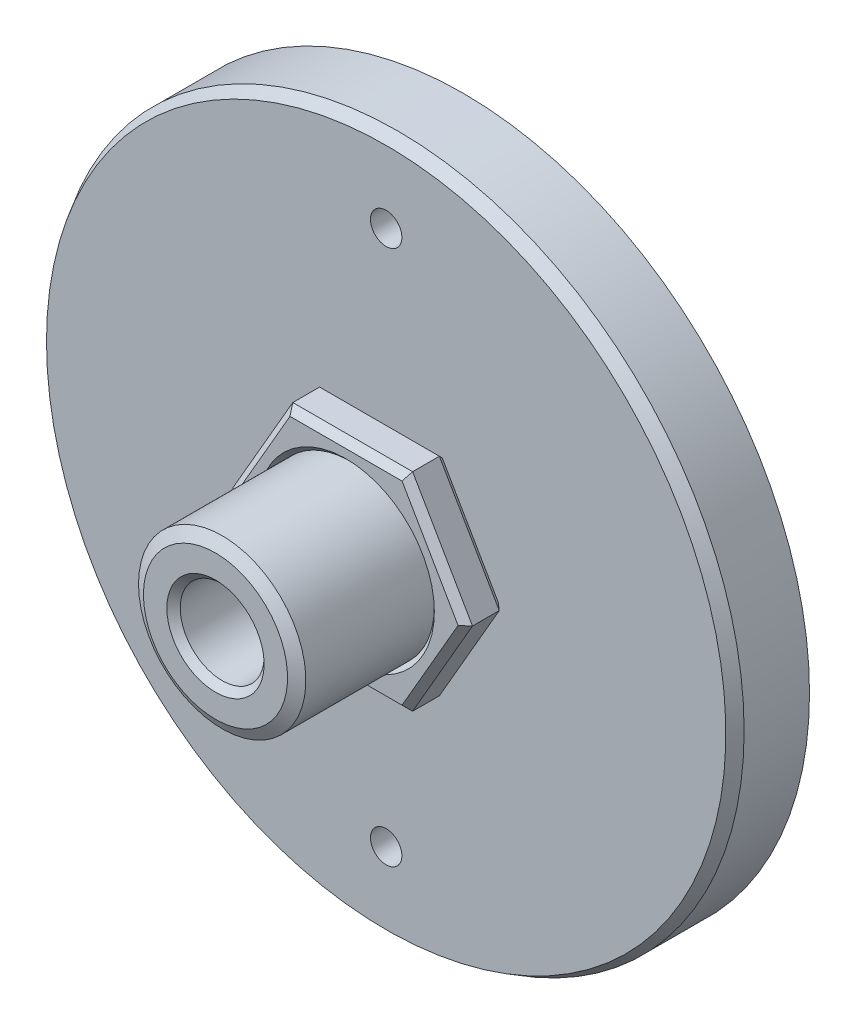
ISO-10303-21;
HEADER;
FILE_DESCRIPTION(('STEP AP214'),'2;1');
FILE_NAME('part.step','',(''),(''),'','','');
FILE_SCHEMA(('AUTOMOTIVE_DESIGN { 1 0 10303 214 1 1 1 1 }'));
ENDSEC;
DATA;
#1=APPLICATION_CONTEXT('core data for automotive mechanical design processes');
#2=APPLICATION_PROTOCOL_DEFINITION('international standard','automotive_design',2000,#1);
#3=PRODUCT_CONTEXT('',#1,'mechanical');
#4=PRODUCT('Part','Part','',(#3));
#5=PRODUCT_RELATED_PRODUCT_CATEGORY('part','',(#4));
#6=PRODUCT_DEFINITION_FORMATION('','',#4);
#7=PRODUCT_DEFINITION_CONTEXT('part definition',#1,'design');
#8=PRODUCT_DEFINITION('design','',#6,#7);
#9=PRODUCT_DEFINITION_SHAPE('','',#8);
#10=(LENGTH_UNIT() NAMED_UNIT(*) SI_UNIT(.MILLI.,.METRE.));
#11=(NAMED_UNIT(*) PLANE_ANGLE_UNIT() SI_UNIT($,.RADIAN.));
#12=(NAMED_UNIT(*) SI_UNIT($,.STERADIAN.) SOLID_ANGLE_UNIT());
#13=UNCERTAINTY_MEASURE_WITH_UNIT(LENGTH_MEASURE(1.E-05),#10,'distance_accuracy_value','');
#14=(GEOMETRIC_REPRESENTATION_CONTEXT(3) GLOBAL_UNCERTAINTY_ASSIGNED_CONTEXT((#13)) GLOBAL_UNIT_ASSIGNED_CONTEXT((#10,
#11,#12)) REPRESENTATION_CONTEXT('',''));
#15=CARTESIAN_POINT('',(0.,0.,0.));
#16=DIRECTION('',(0.,0.,1.));
#17=DIRECTION('',(1.,0.,0.));
#18=AXIS2_PLACEMENT_3D('',#15,#16,#17);
#19=CARTESIAN_POINT('',(2.27302800979955,-3.93700000000001,0.));
#20=DIRECTION('',(0.,1.,0.));
#21=DIRECTION('',(1.,0.,0.));
#22=AXIS2_PLACEMENT_3D('',#19,#20,#21);
#23=PLANE('',#22);
#24=DIRECTION('',(0.,0.,1.));
#25=VECTOR('',#24,1.);
#26=CARTESIAN_POINT('',(2.27302800979955,-3.93700000000001,0.));
#27=LINE('',#26,#25);
#28=CARTESIAN_POINT('',(2.27302800979955,-3.93700000000001,0.254000000000002));
#29=VERTEX_POINT('',#28);
#30=CARTESIAN_POINT('',(2.27302800979955,-3.93700000000001,1.27));
#31=VERTEX_POINT('',#30);
#32=EDGE_CURVE('P0_E212',#29,#31,#27,.T.);
#33=ORIENTED_EDGE('',*,*,#32,.T.);
#34=DIRECTION('',(-1.,0.,0.));
#35=VECTOR('',#34,1.);
#36=CARTESIAN_POINT('',(2.27302800979955,-3.93700000000001,1.27));
#37=LINE('',#36,#35);
#38=CARTESIAN_POINT('',(-2.27302800979955,-3.93700000000001,1.27));
#39=VERTEX_POINT('',#38);
#40=EDGE_CURVE('P0_E178',#31,#39,#37,.T.);
#41=ORIENTED_EDGE('',*,*,#40,.T.);
#42=DIRECTION('',(0.,0.,1.));
#43=VECTOR('',#42,1.);
#44=CARTESIAN_POINT('',(-2.27302800979955,-3.93700000000001,0.));
#45=LINE('',#44,#43);
#46=CARTESIAN_POINT('',(-2.27302800979955,-3.93700000000001,0.254000000000003));
#47=VERTEX_POINT('',#46);
#48=EDGE_CURVE('P0_E128',#47,#39,#45,.T.);
#49=ORIENTED_EDGE('',*,*,#48,.F.);
#50=DIRECTION('',(1.,0.,0.));
#51=VECTOR('',#50,1.);
#52=CARTESIAN_POINT('',(2.27302800979955,-3.93700000000001,0.254000000000002));
#53=LINE('',#52,#51);
#54=EDGE_CURVE('P0_E176',#47,#29,#53,.T.);
#55=ORIENTED_EDGE('',*,*,#54,.T.);
#56=EDGE_LOOP('',(#33,#41,#49,#55));
#57=FACE_BOUND('',#56,.T.);
#58=ADVANCED_FACE('P0_F16',(#57),#23,.F.);
#59=CARTESIAN_POINT('',(-2.27302800979955,-3.93700000000001,0.));
#60=DIRECTION('',(0.866025403784439,0.499999999999999,0.));
#61=DIRECTION('',(0.499999999999999,-0.866025403784439,0.));
#62=AXIS2_PLACEMENT_3D('',#59,#60,#61);
#63=PLANE('',#62);
#64=ORIENTED_EDGE('',*,*,#48,.T.);
#65=DIRECTION('',(-0.499999999999999,0.866025403784439,0.));
#66=VECTOR('',#65,1.);
#67=CARTESIAN_POINT('',(-2.27302800979955,-3.93700000000001,1.27));
#68=LINE('',#67,#66);
#69=CARTESIAN_POINT('',(-4.54605601959911,0.,1.27));
#70=VERTEX_POINT('',#69);
#71=EDGE_CURVE('P0_E127',#39,#70,#68,.T.);
#72=ORIENTED_EDGE('',*,*,#71,.T.);
#73=DIRECTION('',(0.,0.,1.));
#74=VECTOR('',#73,1.);
#75=CARTESIAN_POINT('',(-4.54605601959911,0.,0.));
#76=LINE('',#75,#74);
#77=CARTESIAN_POINT('',(-4.54605601959911,0.,0.254000000000003));
#78=VERTEX_POINT('',#77);
#79=EDGE_CURVE('P0_E109',#78,#70,#76,.T.);
#80=ORIENTED_EDGE('',*,*,#79,.F.);
#81=DIRECTION('',(0.499999999999999,-0.866025403784439,0.));
#82=VECTOR('',#81,1.);
#83=CARTESIAN_POINT('',(-2.27302800979955,-3.93700000000001,0.254000000000003));
#84=LINE('',#83,#82);
#85=EDGE_CURVE('P0_E124',#78,#47,#84,.T.);
#86=ORIENTED_EDGE('',*,*,#85,.T.);
#87=EDGE_LOOP('',(#64,#72,#80,#86));
#88=FACE_BOUND('',#87,.T.);
#89=ADVANCED_FACE('P0_F122',(#88),#63,.F.);
#90=CARTESIAN_POINT('',(-4.54605601959911,0.,0.));
#91=DIRECTION('',(0.866025403784438,-0.5,0.));
#92=DIRECTION('',(0.,0.,1.));
#93=AXIS2_PLACEMENT_3D('',#90,#91,#92);
#94=PLANE('',#93);
#95=ORIENTED_EDGE('',*,*,#79,.T.);
#96=DIRECTION('',(0.5,0.866025403784439,0.));
#97=VECTOR('',#96,1.);
#98=CARTESIAN_POINT('',(-4.54605601959911,0.,1.27));
#99=LINE('',#98,#97);
#100=CARTESIAN_POINT('',(-2.27302800979955,3.93700000000001,1.27));
#101=VERTEX_POINT('',#100);
#102=EDGE_CURVE('P0_E116',#70,#101,#99,.T.);
#103=ORIENTED_EDGE('',*,*,#102,.T.);
#104=DIRECTION('',(0.,0.,1.));
#105=VECTOR('',#104,1.);
#106=CARTESIAN_POINT('',(-2.27302800979955,3.93700000000001,0.));
#107=LINE('',#106,#105);
#108=CARTESIAN_POINT('',(-2.27302800979955,3.93700000000001,0.254000000000003));
#109=VERTEX_POINT('',#108);
#110=EDGE_CURVE('P0_E111',#109,#101,#107,.T.);
#111=ORIENTED_EDGE('',*,*,#110,.F.);
#112=DIRECTION('',(-0.5,-0.866025403784439,0.));
#113=VECTOR('',#112,1.);
#114=CARTESIAN_POINT('',(-4.54605601959911,0.,0.254000000000003));
#115=LINE('',#114,#113);
#116=EDGE_CURVE('P0_E106',#109,#78,#115,.T.);
#117=ORIENTED_EDGE('',*,*,#116,.T.);
#118=EDGE_LOOP('',(#95,#103,#111,#117));
#119=FACE_BOUND('',#118,.T.);
#120=ADVANCED_FACE('P0_F108',(#119),#94,.F.);
#121=CARTESIAN_POINT('',(-2.27302800979955,3.93700000000001,0.));
#122=DIRECTION('',(0.,-1.,0.));
#123=DIRECTION('',(-1.,0.,0.));
#124=AXIS2_PLACEMENT_3D('',#121,#122,#123);
#125=PLANE('',#124);
#126=ORIENTED_EDGE('',*,*,#110,.T.);
#127=DIRECTION('',(1.,0.,0.));
#128=VECTOR('',#127,1.);
#129=CARTESIAN_POINT('',(-2.27302800979955,3.93700000000001,1.27));
#130=LINE('',#129,#128);
#131=CARTESIAN_POINT('',(2.27302800979956,3.93700000000001,1.27));
#132=VERTEX_POINT('',#131);
#133=EDGE_CURVE('P0_E165',#101,#132,#130,.T.);
#134=ORIENTED_EDGE('',*,*,#133,.T.);
#135=DIRECTION('',(0.,0.,1.));
#136=VECTOR('',#135,1.);
#137=CARTESIAN_POINT('',(2.27302800979956,3.93700000000001,0.));
#138=LINE('',#137,#136);
#139=CARTESIAN_POINT('',(2.27302800979956,3.93700000000001,0.254000000000002));
#140=VERTEX_POINT('',#139);
#141=EDGE_CURVE('P0_E230',#140,#132,#138,.T.);
#142=ORIENTED_EDGE('',*,*,#141,.F.);
#143=DIRECTION('',(-1.,0.,0.));
#144=VECTOR('',#143,1.);
#145=CARTESIAN_POINT('',(-2.27302800979955,3.93700000000001,0.254000000000003));
#146=LINE('',#145,#144);
#147=EDGE_CURVE('P0_E163',#140,#109,#146,.T.);
#148=ORIENTED_EDGE('',*,*,#147,.T.);
#149=EDGE_LOOP('',(#126,#134,#142,#148));
#150=FACE_BOUND('',#149,.T.);
#151=ADVANCED_FACE('P0_F227',(#150),#125,.F.);
#152=CARTESIAN_POINT('',(2.27302800979956,3.93700000000001,0.));
#153=DIRECTION('',(-0.866025403784439,-0.499999999999999,0.));
#154=DIRECTION('',(-0.5,0.866025403784439,0.));
#155=AXIS2_PLACEMENT_3D('',#152,#153,#154);
#156=PLANE('',#155);
#157=ORIENTED_EDGE('',*,*,#141,.T.);
#158=DIRECTION('',(0.5,-0.866025403784439,0.));
#159=VECTOR('',#158,1.);
#160=CARTESIAN_POINT('',(2.27302800979956,3.93700000000001,1.27));
#161=LINE('',#160,#159);
#162=CARTESIAN_POINT('',(4.54605601959912,0.,1.27));
#163=VERTEX_POINT('',#162);
#164=EDGE_CURVE('P0_E169',#132,#163,#161,.T.);
#165=ORIENTED_EDGE('',*,*,#164,.T.);
#166=DIRECTION('',(0.,0.,1.));
#167=VECTOR('',#166,1.);
#168=CARTESIAN_POINT('',(4.54605601959912,0.,0.));
#169=LINE('',#168,#167);
#170=CARTESIAN_POINT('',(4.54605601959912,0.,0.254000000000002));
#171=VERTEX_POINT('',#170);
#172=EDGE_CURVE('P0_E233',#171,#163,#169,.T.);
#173=ORIENTED_EDGE('',*,*,#172,.F.);
#174=DIRECTION('',(-0.5,0.866025403784439,0.));
#175=VECTOR('',#174,1.);
#176=CARTESIAN_POINT('',(2.27302800979956,3.93700000000001,0.254000000000002));
#177=LINE('',#176,#175);
#178=EDGE_CURVE('P0_E167',#171,#140,#177,.T.);
#179=ORIENTED_EDGE('',*,*,#178,.T.);
#180=EDGE_LOOP('',(#157,#165,#173,#179));
#181=FACE_BOUND('',#180,.T.);
#182=ADVANCED_FACE('P0_F272',(#181),#156,.F.);
#183=CARTESIAN_POINT('',(4.54605601959912,0.,0.));
#184=DIRECTION('',(-0.866025403784438,0.5,0.));
#185=DIRECTION('',(0.500000000000001,0.866025403784438,0.));
#186=AXIS2_PLACEMENT_3D('',#183,#184,#185);
#187=PLANE('',#186);
#188=ORIENTED_EDGE('',*,*,#172,.T.);
#189=DIRECTION('',(-0.500000000000001,-0.866025403784438,0.));
#190=VECTOR('',#189,1.);
#191=CARTESIAN_POINT('',(4.54605601959912,0.,1.27));
#192=LINE('',#191,#190);
#193=EDGE_CURVE('P0_E174',#163,#31,#192,.T.);
#194=ORIENTED_EDGE('',*,*,#193,.T.);
#195=ORIENTED_EDGE('',*,*,#32,.F.);
#196=DIRECTION('',(0.500000000000001,0.866025403784438,0.));
#197=VECTOR('',#196,1.);
#198=CARTESIAN_POINT('',(4.54605601959912,0.,0.254000000000002));
#199=LINE('',#198,#197);
#200=EDGE_CURVE('P0_E171',#29,#171,#199,.T.);
#201=ORIENTED_EDGE('',*,*,#200,.T.);
#202=EDGE_LOOP('',(#188,#194,#195,#201));
#203=FACE_BOUND('',#202,.T.);
#204=ADVANCED_FACE('P0_F273',(#203),#187,.F.);
#205=CARTESIAN_POINT('',(-2.27302800979955,-3.93700000000001,0.));
#206=DIRECTION('',(0.,0.,-1.));
#207=DIRECTION('',(-0.5,-0.866025403784439,0.));
#208=AXIS2_PLACEMENT_3D('',#205,#206,#207);
#209=PLANE('',#208);
#210=DIRECTION('',(0.5,-0.866025403784439,0.));
#211=VECTOR('',#210,1.);
#212=CARTESIAN_POINT('',(4.32608556703787,-0.126999999999993,0.));
#213=LINE('',#212,#211);
#214=CARTESIAN_POINT('',(2.1263810414254,3.68300000000001,0.));
#215=VERTEX_POINT('',#214);
#216=CARTESIAN_POINT('',(4.25276208285078,0.,0.));
#217=VERTEX_POINT('',#216);
#218=EDGE_CURVE('P0_E25',#215,#217,#213,.T.);
#219=ORIENTED_EDGE('',*,*,#218,.T.);
#220=DIRECTION('',(-0.500000000000001,-0.866025403784438,0.));
#221=VECTOR('',#220,1.);
#222=CARTESIAN_POINT('',(2.0530575572383,-3.81000000000001,0.));
#223=LINE('',#222,#221);
#224=CARTESIAN_POINT('',(2.12638104142538,-3.68300000000001,0.));
#225=VERTEX_POINT('',#224);
#226=EDGE_CURVE('P0_E11',#217,#225,#223,.T.);
#227=ORIENTED_EDGE('',*,*,#226,.T.);
#228=DIRECTION('',(-1.,0.,0.));
#229=VECTOR('',#228,1.);
#230=CARTESIAN_POINT('',(-2.27302800979955,-3.683,0.));
#231=LINE('',#230,#229);
#232=CARTESIAN_POINT('',(-2.12638104142538,-3.683,0.));
#233=VERTEX_POINT('',#232);
#234=EDGE_CURVE('P0_E189',#225,#233,#231,.T.);
#235=ORIENTED_EDGE('',*,*,#234,.T.);
#236=DIRECTION('',(-0.499999999999999,0.866025403784439,0.));
#237=VECTOR('',#236,1.);
#238=CARTESIAN_POINT('',(-4.32608556703786,0.127000000000012,0.));
#239=LINE('',#238,#237);
#240=CARTESIAN_POINT('',(-4.25276208285078,0.,0.));
#241=VERTEX_POINT('',#240);
#242=EDGE_CURVE('P0_E191',#233,#241,#239,.T.);
#243=ORIENTED_EDGE('',*,*,#242,.T.);
#244=DIRECTION('',(0.5,0.866025403784439,0.));
#245=VECTOR('',#244,1.);
#246=CARTESIAN_POINT('',(-2.05305755723831,3.81000000000001,0.));
#247=LINE('',#246,#245);
#248=CARTESIAN_POINT('',(-2.12638104142539,3.68300000000001,0.));
#249=VERTEX_POINT('',#248);
#250=EDGE_CURVE('P0_E134',#241,#249,#247,.T.);
#251=ORIENTED_EDGE('',*,*,#250,.T.);
#252=DIRECTION('',(1.,0.,0.));
#253=VECTOR('',#252,1.);
#254=CARTESIAN_POINT('',(2.27302800979956,3.68300000000001,0.));
#255=LINE('',#254,#253);
#256=EDGE_CURVE('P0_E36',#249,#215,#255,.T.);
#257=ORIENTED_EDGE('',*,*,#256,.T.);
#258=EDGE_LOOP('',(#219,#227,#235,#243,#251,#257));
#259=FACE_BOUND('',#258,.T.);
#260=CARTESIAN_POINT('',(0.,0.,0.));
#261=DIRECTION('',(0.,0.,-1.));
#262=DIRECTION('',(-0.5,-0.866025403784439,0.));
#263=AXIS2_PLACEMENT_3D('',#260,#261,#262);
#264=CIRCLE('',#263,3.35280000000001);
#265=CARTESIAN_POINT('',(-1.6764,-2.90360997380847,0.));
#266=VERTEX_POINT('',#265);
#267=EDGE_CURVE('P0_E186',#266,#266,#264,.F.);
#268=ORIENTED_EDGE('',*,*,#267,.T.);
#269=EDGE_LOOP('',(#268));
#270=FACE_BOUND('',#269,.T.);
#271=ADVANCED_FACE('P0_F281',(#259,#270),#209,.T.);
#272=CARTESIAN_POINT('',(-2.27302800979955,-3.93700000000001,1.524));
#273=DIRECTION('',(0.,0.,-1.));
#274=DIRECTION('',(-0.5,-0.866025403784439,0.));
#275=AXIS2_PLACEMENT_3D('',#272,#273,#274);
#276=PLANE('',#275);
#277=DIRECTION('',(-0.5,-0.866025403784439,0.));
#278=VECTOR('',#277,1.);
#279=CARTESIAN_POINT('',(-5.46259957193765,-2.0955,1.524));
#280=LINE('',#279,#278);
#281=CARTESIAN_POINT('',(-2.12638104142539,3.68300000000001,1.524));
#282=VERTEX_POINT('',#281);
#283=CARTESIAN_POINT('',(-4.25276208285078,0.,1.524));
#284=VERTEX_POINT('',#283);
#285=EDGE_CURVE('P0_E158',#282,#284,#280,.T.);
#286=ORIENTED_EDGE('',*,*,#285,.T.);
#287=DIRECTION('',(0.499999999999999,-0.866025403784439,0.));
#288=VECTOR('',#287,1.);
#289=CARTESIAN_POINT('',(-2.0530575572383,-3.81000000000001,1.524));
#290=LINE('',#289,#288);
#291=CARTESIAN_POINT('',(-2.12638104142538,-3.683,1.524));
#292=VERTEX_POINT('',#291);
#293=EDGE_CURVE('P0_E117',#284,#292,#290,.T.);
#294=ORIENTED_EDGE('',*,*,#293,.T.);
#295=DIRECTION('',(1.,0.,0.));
#296=VECTOR('',#295,1.);
#297=CARTESIAN_POINT('',(-2.27302800979955,-3.683,1.524));
#298=LINE('',#297,#296);
#299=CARTESIAN_POINT('',(2.12638104142538,-3.68300000000001,1.524));
#300=VERTEX_POINT('',#299);
#301=EDGE_CURVE('P0_E150',#292,#300,#298,.T.);
#302=ORIENTED_EDGE('',*,*,#301,.T.);
#303=DIRECTION('',(0.500000000000001,0.866025403784438,0.));
#304=VECTOR('',#303,1.);
#305=CARTESIAN_POINT('',(0.916543552338524,-5.7785,1.524));
#306=LINE('',#305,#304);
#307=CARTESIAN_POINT('',(4.25276208285078,0.,1.524));
#308=VERTEX_POINT('',#307);
#309=EDGE_CURVE('P0_E152',#300,#308,#306,.T.);
#310=ORIENTED_EDGE('',*,*,#309,.T.);
#311=DIRECTION('',(-0.5,0.866025403784439,0.));
#312=VECTOR('',#311,1.);
#313=CARTESIAN_POINT('',(4.32608556703788,-0.127000000000009,1.524));
#314=LINE('',#313,#312);
#315=CARTESIAN_POINT('',(2.1263810414254,3.68300000000001,1.524));
#316=VERTEX_POINT('',#315);
#317=EDGE_CURVE('P0_E154',#308,#316,#314,.T.);
#318=ORIENTED_EDGE('',*,*,#317,.T.);
#319=DIRECTION('',(-1.,0.,0.));
#320=VECTOR('',#319,1.);
#321=CARTESIAN_POINT('',(-2.27302800979955,3.68300000000001,1.524));
#322=LINE('',#321,#320);
#323=EDGE_CURVE('P0_E156',#316,#282,#322,.T.);
#324=ORIENTED_EDGE('',*,*,#323,.T.);
#325=EDGE_LOOP('',(#286,#294,#302,#310,#318,#324));
#326=FACE_BOUND('',#325,.T.);
#327=CARTESIAN_POINT('',(0.,0.,1.524));
#328=DIRECTION('',(0.,0.,-1.));
#329=DIRECTION('',(-0.5,-0.866025403784439,0.));
#330=AXIS2_PLACEMENT_3D('',#327,#328,#329);
#331=CIRCLE('',#330,3.35279999999999);
#332=CARTESIAN_POINT('',(-1.6764,-2.90360997380846,1.524));
#333=VERTEX_POINT('',#332);
#334=EDGE_CURVE('P0_E144',#333,#333,#331,.T.);
#335=ORIENTED_EDGE('',*,*,#334,.T.);
#336=EDGE_LOOP('',(#335));
#337=FACE_BOUND('',#336,.T.);
#338=ADVANCED_FACE('P0_F284',(#326,#337),#276,.F.);
#339=CARTESIAN_POINT('',(0.,0.,1.524));
#340=DIRECTION('',(0.,0.,-1.));
#341=DIRECTION('',(-0.5,-0.866025403784439,0.));
#342=AXIS2_PLACEMENT_3D('',#339,#340,#341);
#343=CYLINDRICAL_SURFACE('',#342,3.0988);
#344=CARTESIAN_POINT('',(0.,0.,1.27000000000001));
#345=DIRECTION('',(0.,0.,-1.));
#346=DIRECTION('',(-0.5,-0.866025403784439,0.));
#347=AXIS2_PLACEMENT_3D('',#344,#345,#346);
#348=CIRCLE('',#347,3.0988);
#349=CARTESIAN_POINT('',(-1.5494,-2.68363952124722,1.27000000000001));
#350=VERTEX_POINT('',#349);
#351=EDGE_CURVE('P0_E183',#350,#350,#348,.F.);
#352=ORIENTED_EDGE('',*,*,#351,.T.);
#353=EDGE_LOOP('',(#352));
#354=FACE_BOUND('',#353,.T.);
#355=CARTESIAN_POINT('',(0.,0.,0.254000000000005));
#356=DIRECTION('',(0.,0.,-1.));
#357=DIRECTION('',(-0.5,-0.866025403784439,0.));
#358=AXIS2_PLACEMENT_3D('',#355,#356,#357);
#359=CIRCLE('',#358,3.0988);
#360=CARTESIAN_POINT('',(-1.5494,-2.68363952124722,0.254000000000005));
#361=VERTEX_POINT('',#360);
#362=EDGE_CURVE('P0_E180',#361,#361,#359,.T.);
#363=ORIENTED_EDGE('',*,*,#362,.T.);
#364=EDGE_LOOP('',(#363));
#365=FACE_BOUND('',#364,.T.);
#366=ADVANCED_FACE('P0_F292',(#354,#365),#343,.F.);
#367=CARTESIAN_POINT('',(2.27302800979956,3.93700000000001,1.27));
#368=DIRECTION('',(-0.612372435695793,-0.353553390593272,-0.707106781186549));
#369=DIRECTION('',(-0.377964473009228,-0.654653670707979,0.654653670707975));
#370=AXIS2_PLACEMENT_3D('',#367,#368,#369);
#371=PLANE('',#370);
#372=DIRECTION('',(-0.377964473009231,-0.654653670707976,0.654653670707976));
#373=VECTOR('',#372,1.);
#374=CARTESIAN_POINT('',(2.27302800979956,3.93700000000001,1.27));
#375=LINE('',#374,#373);
#376=EDGE_CURVE('P0_E206',#316,#132,#375,.F.);
#377=ORIENTED_EDGE('',*,*,#376,.F.);
#378=ORIENTED_EDGE('',*,*,#317,.F.);
#379=DIRECTION('',(-0.755928946018456,0.,0.654653670707975));
#380=VECTOR('',#379,1.);
#381=CARTESIAN_POINT('',(4.54605601959912,0.,1.27));
#382=LINE('',#381,#380);
#383=EDGE_CURVE('P0_E209',#163,#308,#382,.T.);
#384=ORIENTED_EDGE('',*,*,#383,.F.);
#385=ORIENTED_EDGE('',*,*,#164,.F.);
#386=EDGE_LOOP('',(#377,#378,#384,#385));
#387=FACE_BOUND('',#386,.T.);
#388=ADVANCED_FACE('P0_F269',(#387),#371,.F.);
#389=CARTESIAN_POINT('',(4.54605601959912,0.,1.27));
#390=DIRECTION('',(-0.612372435695792,0.353553390593273,-0.70710678118655));
#391=DIRECTION('',(0.612372435695796,-0.353553390593275,-0.707106781186545));
#392=AXIS2_PLACEMENT_3D('',#389,#390,#391);
#393=PLANE('',#392);
#394=ORIENTED_EDGE('',*,*,#383,.T.);
#395=ORIENTED_EDGE('',*,*,#309,.F.);
#396=DIRECTION('',(-0.377964473009229,0.654653670707978,0.654653670707975));
#397=VECTOR('',#396,1.);
#398=CARTESIAN_POINT('',(2.27302800979955,-3.93700000000001,1.27));
#399=LINE('',#398,#397);
#400=EDGE_CURVE('P0_E203',#31,#300,#399,.T.);
#401=ORIENTED_EDGE('',*,*,#400,.F.);
#402=ORIENTED_EDGE('',*,*,#193,.F.);
#403=EDGE_LOOP('',(#394,#395,#401,#402));
#404=FACE_BOUND('',#403,.T.);
#405=ADVANCED_FACE('P0_F249',(#404),#393,.F.);
#406=CARTESIAN_POINT('',(-2.27302800979955,3.93700000000001,1.27));
#407=DIRECTION('',(0.,-0.707106781186547,-0.707106781186547));
#408=DIRECTION('',(-0.377964473009227,-0.654653670707977,0.654653670707977));
#409=AXIS2_PLACEMENT_3D('',#406,#407,#408);
#410=PLANE('',#409);
#411=ORIENTED_EDGE('',*,*,#376,.T.);
#412=ORIENTED_EDGE('',*,*,#133,.F.);
#413=DIRECTION('',(0.377964473009232,-0.654653670707976,0.654653670707976));
#414=VECTOR('',#413,1.);
#415=CARTESIAN_POINT('',(-2.27302800979955,3.93700000000001,1.27));
#416=LINE('',#415,#414);
#417=EDGE_CURVE('P0_E200',#282,#101,#416,.F.);
#418=ORIENTED_EDGE('',*,*,#417,.F.);
#419=ORIENTED_EDGE('',*,*,#323,.F.);
#420=EDGE_LOOP('',(#411,#412,#418,#419));
#421=FACE_BOUND('',#420,.T.);
#422=ADVANCED_FACE('P0_F265',(#421),#410,.F.);
#423=CARTESIAN_POINT('',(2.27302800979955,-3.93700000000001,1.27));
#424=DIRECTION('',(0.,0.707106781186546,-0.707106781186549));
#425=DIRECTION('',(-0.377964473009228,-0.654653670707978,-0.654653670707976));
#426=AXIS2_PLACEMENT_3D('',#423,#424,#425);
#427=PLANE('',#426);
#428=ORIENTED_EDGE('',*,*,#400,.T.);
#429=ORIENTED_EDGE('',*,*,#301,.F.);
#430=DIRECTION('',(-0.37796447300923,-0.654653670707978,-0.654653670707975));
#431=VECTOR('',#430,1.);
#432=CARTESIAN_POINT('',(-1.6235914355711,-2.81214285714286,2.39485714285714));
#433=LINE('',#432,#431);
#434=EDGE_CURVE('P0_E198',#39,#292,#433,.F.);
#435=ORIENTED_EDGE('',*,*,#434,.F.);
#436=ORIENTED_EDGE('',*,*,#40,.F.);
#437=EDGE_LOOP('',(#428,#429,#435,#436));
#438=FACE_BOUND('',#437,.T.);
#439=ADVANCED_FACE('P0_F253',(#438),#427,.F.);
#440=CARTESIAN_POINT('',(-4.54605601959911,0.,1.27));
#441=DIRECTION('',(0.612372435695792,-0.353553390593273,-0.70710678118655));
#442=DIRECTION('',(0.612372435695797,-0.353553390593275,0.707106781186545));
#443=AXIS2_PLACEMENT_3D('',#440,#441,#442);
#444=PLANE('',#443);
#445=ORIENTED_EDGE('',*,*,#417,.T.);
#446=ORIENTED_EDGE('',*,*,#102,.F.);
#447=DIRECTION('',(0.755928946018457,0.,0.654653670707975));
#448=VECTOR('',#447,1.);
#449=CARTESIAN_POINT('',(-4.54605601959911,0.,1.27));
#450=LINE('',#449,#448);
#451=EDGE_CURVE('P0_E196',#284,#70,#450,.F.);
#452=ORIENTED_EDGE('',*,*,#451,.F.);
#453=ORIENTED_EDGE('',*,*,#285,.F.);
#454=EDGE_LOOP('',(#445,#446,#452,#453));
#455=FACE_BOUND('',#454,.T.);
#456=ADVANCED_FACE('P0_F261',(#455),#444,.F.);
#457=CARTESIAN_POINT('',(-2.27302800979955,-3.93700000000001,1.27));
#458=DIRECTION('',(0.612372435695793,0.353553390593272,-0.70710678118655));
#459=DIRECTION('',(-0.377964473009228,-0.654653670707979,-0.654653670707975));
#460=AXIS2_PLACEMENT_3D('',#457,#458,#459);
#461=PLANE('',#460);
#462=ORIENTED_EDGE('',*,*,#434,.T.);
#463=ORIENTED_EDGE('',*,*,#293,.F.);
#464=ORIENTED_EDGE('',*,*,#451,.T.);
#465=ORIENTED_EDGE('',*,*,#71,.F.);
#466=EDGE_LOOP('',(#462,#463,#464,#465));
#467=FACE_BOUND('',#466,.T.);
#468=ADVANCED_FACE('P0_F256',(#467),#461,.F.);
#469=CARTESIAN_POINT('',(0.,0.,1.524));
#470=DIRECTION('',(0.,0.,1.));
#471=DIRECTION('',(0.5,0.866025403784439,0.));
#472=AXIS2_PLACEMENT_3D('',#469,#470,#471);
#473=CONICAL_SURFACE('',#472,3.35279999999999,0.785398163397449);
#474=ORIENTED_EDGE('',*,*,#351,.F.);
#475=EDGE_LOOP('',(#474));
#476=FACE_BOUND('',#475,.T.);
#477=ORIENTED_EDGE('',*,*,#334,.F.);
#478=EDGE_LOOP('',(#477));
#479=FACE_BOUND('',#478,.T.);
#480=ADVANCED_FACE('P0_F314',(#476,#479),#473,.F.);
#481=CARTESIAN_POINT('',(-5.46259957193765,-2.0955,0.));
#482=DIRECTION('',(-0.612372435695797,0.353553390593275,-0.707106781186545));
#483=DIRECTION('',(0.612372435695792,-0.353553390593273,-0.70710678118655));
#484=AXIS2_PLACEMENT_3D('',#481,#482,#483);
#485=PLANE('',#484);
#486=DIRECTION('',(0.755928946018452,0.,-0.65465367070798));
#487=VECTOR('',#486,1.);
#488=CARTESIAN_POINT('',(-2.99578806821508,0.,-1.08857142857143));
#489=LINE('',#488,#487);
#490=EDGE_CURVE('P0_E132',#78,#241,#489,.T.);
#491=ORIENTED_EDGE('',*,*,#490,.F.);
#492=ORIENTED_EDGE('',*,*,#116,.F.);
#493=DIRECTION('',(0.37796447300923,-0.654653670707972,-0.654653670707981));
#494=VECTOR('',#493,1.);
#495=CARTESIAN_POINT('',(-1.17317574699332,2.03200000000004,-1.65099999999999));
#496=LINE('',#495,#494);
#497=EDGE_CURVE('P0_E20',#249,#109,#496,.F.);
#498=ORIENTED_EDGE('',*,*,#497,.F.);
#499=ORIENTED_EDGE('',*,*,#250,.F.);
#500=EDGE_LOOP('',(#491,#492,#498,#499));
#501=FACE_BOUND('',#500,.T.);
#502=ADVANCED_FACE('P0_F133',(#501),#485,.T.);
#503=CARTESIAN_POINT('',(-2.27302800979955,3.68300000000001,0.));
#504=DIRECTION('',(0.,0.707106781186553,-0.707106781186543));
#505=DIRECTION('',(-0.377964473009225,-0.654653670707973,-0.654653670707982));
#506=AXIS2_PLACEMENT_3D('',#503,#504,#505);
#507=PLANE('',#506);
#508=ORIENTED_EDGE('',*,*,#497,.T.);
#509=ORIENTED_EDGE('',*,*,#147,.F.);
#510=DIRECTION('',(-0.377964473009229,-0.654653670707972,-0.654653670707981));
#511=VECTOR('',#510,1.);
#512=CARTESIAN_POINT('',(1.49789403410754,2.59442857142858,-1.08857142857144));
#513=LINE('',#512,#511);
#514=EDGE_CURVE('P0_E137',#215,#140,#513,.F.);
#515=ORIENTED_EDGE('',*,*,#514,.F.);
#516=ORIENTED_EDGE('',*,*,#256,.F.);
#517=EDGE_LOOP('',(#508,#509,#515,#516));
#518=FACE_BOUND('',#517,.T.);
#519=ADVANCED_FACE('P0_F224',(#518),#507,.T.);
#520=CARTESIAN_POINT('',(-2.0530575572383,-3.81000000000001,0.));
#521=DIRECTION('',(-0.612372435695797,-0.353553390593274,-0.707106781186545));
#522=DIRECTION('',(-0.377964473009226,-0.654653670707975,0.65465367070798));
#523=AXIS2_PLACEMENT_3D('',#520,#521,#522);
#524=PLANE('',#523);
#525=ORIENTED_EDGE('',*,*,#490,.T.);
#526=ORIENTED_EDGE('',*,*,#242,.F.);
#527=DIRECTION('',(0.377964473009227,0.654653670707974,-0.65465367070798));
#528=VECTOR('',#527,1.);
#529=CARTESIAN_POINT('',(-2.14733060833598,-3.71928571428572,0.0362857142857147));
#530=LINE('',#529,#528);
#531=EDGE_CURVE('P0_E141',#47,#233,#530,.T.);
#532=ORIENTED_EDGE('',*,*,#531,.F.);
#533=ORIENTED_EDGE('',*,*,#85,.F.);
#534=EDGE_LOOP('',(#525,#526,#532,#533));
#535=FACE_BOUND('',#534,.T.);
#536=ADVANCED_FACE('P0_F139',(#535),#524,.T.);
#537=CARTESIAN_POINT('',(4.32608556703788,-0.127000000000009,0.));
#538=DIRECTION('',(0.612372435695797,0.353553390593275,-0.707106781186545));
#539=DIRECTION('',(-0.377964473009226,-0.654653670707975,-0.65465367070798));
#540=AXIS2_PLACEMENT_3D('',#537,#538,#539);
#541=PLANE('',#540);
#542=ORIENTED_EDGE('',*,*,#514,.T.);
#543=ORIENTED_EDGE('',*,*,#178,.F.);
#544=DIRECTION('',(-0.755928946018452,0.,-0.65465367070798));
#545=VECTOR('',#544,1.);
#546=CARTESIAN_POINT('',(4.29466121667198,0.,0.0362857142857185));
#547=LINE('',#546,#545);
#548=EDGE_CURVE('P0_E215',#217,#171,#547,.F.);
#549=ORIENTED_EDGE('',*,*,#548,.F.);
#550=ORIENTED_EDGE('',*,*,#218,.F.);
#551=EDGE_LOOP('',(#542,#543,#549,#550));
#552=FACE_BOUND('',#551,.T.);
#553=ADVANCED_FACE('P0_F221',(#552),#541,.T.);
#554=CARTESIAN_POINT('',(-2.27302800979955,-3.683,0.));
#555=DIRECTION('',(0.,-0.707106781186551,-0.707106781186544));
#556=DIRECTION('',(-0.377964473009226,-0.654653670707974,0.654653670707981));
#557=AXIS2_PLACEMENT_3D('',#554,#555,#556);
#558=PLANE('',#557);
#559=ORIENTED_EDGE('',*,*,#531,.T.);
#560=ORIENTED_EDGE('',*,*,#234,.F.);
#561=DIRECTION('',(0.377964473009227,-0.654653670707974,0.65465367070798));
#562=VECTOR('',#561,1.);
#563=CARTESIAN_POINT('',(1.49789403410753,-2.59442857142859,-1.08857142857143));
#564=LINE('',#563,#562);
#565=EDGE_CURVE('P0_E213',#29,#225,#564,.F.);
#566=ORIENTED_EDGE('',*,*,#565,.F.);
#567=ORIENTED_EDGE('',*,*,#54,.F.);
#568=EDGE_LOOP('',(#559,#560,#566,#567));
#569=FACE_BOUND('',#568,.T.);
#570=ADVANCED_FACE('P0_F280',(#569),#558,.T.);
#571=CARTESIAN_POINT('',(0.916543552338523,-5.7785,0.));
#572=DIRECTION('',(0.612372435695796,-0.353553390593275,-0.707106781186545));
#573=DIRECTION('',(0.612372435695792,-0.353553390593273,0.70710678118655));
#574=AXIS2_PLACEMENT_3D('',#571,#572,#573);
#575=PLANE('',#574);
#576=ORIENTED_EDGE('',*,*,#548,.T.);
#577=ORIENTED_EDGE('',*,*,#200,.F.);
#578=ORIENTED_EDGE('',*,*,#565,.T.);
#579=ORIENTED_EDGE('',*,*,#226,.F.);
#580=EDGE_LOOP('',(#576,#577,#578,#579));
#581=FACE_BOUND('',#580,.T.);
#582=ADVANCED_FACE('P0_F276',(#581),#575,.T.);
#583=CARTESIAN_POINT('',(0.,0.,0.254000000000005));
#584=DIRECTION('',(0.,0.,-1.));
#585=DIRECTION('',(-0.5,-0.866025403784439,0.));
#586=AXIS2_PLACEMENT_3D('',#583,#584,#585);
#587=CONICAL_SURFACE('',#586,3.0988,0.785398163397451);
#588=ORIENTED_EDGE('',*,*,#267,.F.);
#589=EDGE_LOOP('',(#588));
#590=FACE_BOUND('',#589,.T.);
#591=ORIENTED_EDGE('',*,*,#362,.F.);
#592=EDGE_LOOP('',(#591));
#593=FACE_BOUND('',#592,.T.);
#594=ADVANCED_FACE('P0_F18',(#590,#593),#587,.F.);
#595=CLOSED_SHELL('',(#58,#89,#120,#151,#182,#204,#271,#338,#366,#388,#405,#422,#439,#456,#468,
#480,#502,#519,#536,#553,#570,#582,#594));
#596=MANIFOLD_SOLID_BREP('P0_B1',#595);
#597=CARTESIAN_POINT('',(0.,0.,-3.175));
#598=DIRECTION('',(0.,0.,-1.));
#599=DIRECTION('',(-1.,0.,0.));
#600=AXIS2_PLACEMENT_3D('',#597,#598,#599);
#601=PLANE('',#600);
#602=CARTESIAN_POINT('',(0.,0.,-3.175));
#603=DIRECTION('',(0.,0.,-1.));
#604=DIRECTION('',(-1.,0.,0.));
#605=AXIS2_PLACEMENT_3D('',#602,#603,#604);
#606=CIRCLE('',#605,2.73505909487751);
#607=CARTESIAN_POINT('',(-2.73505909487751,0.,-3.175));
#608=VERTEX_POINT('',#607);
#609=EDGE_CURVE('P1_E29',#608,#608,#606,.T.);
#610=ORIENTED_EDGE('',*,*,#609,.T.);
#611=EDGE_LOOP('',(#610));
#612=FACE_BOUND('',#611,.T.);
#613=CARTESIAN_POINT('',(0.,0.,-3.175));
#614=DIRECTION('',(0.,0.,-1.));
#615=DIRECTION('',(-1.,0.,0.));
#616=AXIS2_PLACEMENT_3D('',#613,#614,#615);
#617=CIRCLE('',#616,1.84531);
#618=CARTESIAN_POINT('',(-1.84531,0.,-3.175));
#619=VERTEX_POINT('',#618);
#620=EDGE_CURVE('P1_E34',#619,#619,#617,.F.);
#621=ORIENTED_EDGE('',*,*,#620,.T.);
#622=EDGE_LOOP('',(#621));
#623=FACE_BOUND('',#622,.T.);
#624=ADVANCED_FACE('P1_F14',(#612,#623),#601,.T.);
#625=CARTESIAN_POINT('',(0.,0.,6.477));
#626=DIRECTION('',(0.,0.,-1.));
#627=DIRECTION('',(-1.,0.,0.));
#628=AXIS2_PLACEMENT_3D('',#625,#626,#627);
#629=PLANE('',#628);
#630=CARTESIAN_POINT('',(0.,0.,6.477));
#631=DIRECTION('',(0.,0.,-1.));
#632=DIRECTION('',(-1.,0.,0.));
#633=AXIS2_PLACEMENT_3D('',#630,#631,#632);
#634=CIRCLE('',#633,2.73505909487751);
#635=CARTESIAN_POINT('',(-2.73505909487751,0.,6.477));
#636=VERTEX_POINT('',#635);
#637=EDGE_CURVE('P1_E10',#636,#636,#634,.F.);
#638=ORIENTED_EDGE('',*,*,#637,.T.);
#639=EDGE_LOOP('',(#638));
#640=FACE_BOUND('',#639,.T.);
#641=CARTESIAN_POINT('',(0.,0.,6.477));
#642=DIRECTION('',(0.,0.,-1.));
#643=DIRECTION('',(-1.,0.,0.));
#644=AXIS2_PLACEMENT_3D('',#641,#642,#643);
#645=CIRCLE('',#644,1.84531);
#646=CARTESIAN_POINT('',(-1.84531,0.,6.477));
#647=VERTEX_POINT('',#646);
#648=EDGE_CURVE('P1_E43',#647,#647,#645,.T.);
#649=ORIENTED_EDGE('',*,*,#648,.T.);
#650=EDGE_LOOP('',(#649));
#651=FACE_BOUND('',#650,.T.);
#652=ADVANCED_FACE('P1_F47',(#640,#651),#629,.F.);
#653=CARTESIAN_POINT('',(0.,0.,-3.175));
#654=DIRECTION('',(0.,0.,1.));
#655=DIRECTION('',(1.,0.,0.));
#656=AXIS2_PLACEMENT_3D('',#653,#654,#655);
#657=CYLINDRICAL_SURFACE('',#656,3.175);
#658=CARTESIAN_POINT('',(0.,0.,-2.921));
#659=DIRECTION('',(0.,0.,-1.));
#660=DIRECTION('',(-1.,0.,0.));
#661=AXIS2_PLACEMENT_3D('',#658,#659,#660);
#662=CIRCLE('',#661,3.175);
#663=CARTESIAN_POINT('',(-3.175,0.,-2.921));
#664=VERTEX_POINT('',#663);
#665=EDGE_CURVE('P1_E21',#664,#664,#662,.F.);
#666=ORIENTED_EDGE('',*,*,#665,.T.);
#667=EDGE_LOOP('',(#666));
#668=FACE_BOUND('',#667,.T.);
#669=CARTESIAN_POINT('',(0.,0.,6.223));
#670=DIRECTION('',(0.,0.,-1.));
#671=DIRECTION('',(-1.,0.,0.));
#672=AXIS2_PLACEMENT_3D('',#669,#670,#671);
#673=CIRCLE('',#672,3.175);
#674=CARTESIAN_POINT('',(-3.175,0.,6.223));
#675=VERTEX_POINT('',#674);
#676=EDGE_CURVE('P1_E25',#675,#675,#673,.T.);
#677=ORIENTED_EDGE('',*,*,#676,.T.);
#678=EDGE_LOOP('',(#677));
#679=FACE_BOUND('',#678,.T.);
#680=ADVANCED_FACE('P1_F63',(#668,#679),#657,.T.);
#681=CARTESIAN_POINT('',(0.,0.,-3.175));
#682=DIRECTION('',(0.,0.,1.));
#683=DIRECTION('',(1.,0.,0.));
#684=AXIS2_PLACEMENT_3D('',#681,#682,#683);
#685=CYLINDRICAL_SURFACE('',#684,1.59131);
#686=CARTESIAN_POINT('',(0.,0.,6.223));
#687=DIRECTION('',(0.,0.,-1.));
#688=DIRECTION('',(-1.,0.,0.));
#689=AXIS2_PLACEMENT_3D('',#686,#687,#688);
#690=CIRCLE('',#689,1.59131);
#691=CARTESIAN_POINT('',(-1.59131,0.,6.223));
#692=VERTEX_POINT('',#691);
#693=EDGE_CURVE('P1_E37',#692,#692,#690,.F.);
#694=ORIENTED_EDGE('',*,*,#693,.T.);
#695=EDGE_LOOP('',(#694));
#696=FACE_BOUND('',#695,.T.);
#697=CARTESIAN_POINT('',(0.,0.,-2.92100000000001));
#698=DIRECTION('',(0.,0.,-1.));
#699=DIRECTION('',(-1.,0.,0.));
#700=AXIS2_PLACEMENT_3D('',#697,#698,#699);
#701=CIRCLE('',#700,1.59131);
#702=CARTESIAN_POINT('',(-1.59131,0.,-2.92100000000001));
#703=VERTEX_POINT('',#702);
#704=EDGE_CURVE('P1_E40',#703,#703,#701,.T.);
#705=ORIENTED_EDGE('',*,*,#704,.T.);
#706=EDGE_LOOP('',(#705));
#707=FACE_BOUND('',#706,.T.);
#708=ADVANCED_FACE('P1_F52',(#696,#707),#685,.F.);
#709=CARTESIAN_POINT('',(0.,0.,6.477));
#710=DIRECTION('',(0.,0.,1.));
#711=DIRECTION('',(1.,0.,0.));
#712=AXIS2_PLACEMENT_3D('',#709,#710,#711);
#713=CONICAL_SURFACE('',#712,1.84531,0.785398163397449);
#714=ORIENTED_EDGE('',*,*,#693,.F.);
#715=EDGE_LOOP('',(#714));
#716=FACE_BOUND('',#715,.T.);
#717=ORIENTED_EDGE('',*,*,#648,.F.);
#718=EDGE_LOOP('',(#717));
#719=FACE_BOUND('',#718,.T.);
#720=ADVANCED_FACE('P1_F49',(#716,#719),#713,.F.);
#721=CARTESIAN_POINT('',(0.,0.,-2.92100000000001));
#722=DIRECTION('',(0.,0.,-1.));
#723=DIRECTION('',(-1.,0.,0.));
#724=AXIS2_PLACEMENT_3D('',#721,#722,#723);
#725=CONICAL_SURFACE('',#724,1.59131,0.785398163397449);
#726=ORIENTED_EDGE('',*,*,#620,.F.);
#727=EDGE_LOOP('',(#726));
#728=FACE_BOUND('',#727,.T.);
#729=ORIENTED_EDGE('',*,*,#704,.F.);
#730=EDGE_LOOP('',(#729));
#731=FACE_BOUND('',#730,.T.);
#732=ADVANCED_FACE('P1_F51',(#728,#731),#725,.F.);
#733=CARTESIAN_POINT('',(0.,0.,-3.175));
#734=DIRECTION('',(0.,0.,1.));
#735=DIRECTION('',(1.,0.,0.));
#736=AXIS2_PLACEMENT_3D('',#733,#734,#735);
#737=CONICAL_SURFACE('',#736,2.73505909487751,1.0471975511966);
#738=ORIENTED_EDGE('',*,*,#665,.F.);
#739=EDGE_LOOP('',(#738));
#740=FACE_BOUND('',#739,.T.);
#741=ORIENTED_EDGE('',*,*,#609,.F.);
#742=EDGE_LOOP('',(#741));
#743=FACE_BOUND('',#742,.T.);
#744=ADVANCED_FACE('P1_F60',(#740,#743),#737,.T.);
#745=CARTESIAN_POINT('',(0.,0.,6.223));
#746=DIRECTION('',(0.,0.,-1.));
#747=DIRECTION('',(-1.,0.,0.));
#748=AXIS2_PLACEMENT_3D('',#745,#746,#747);
#749=CONICAL_SURFACE('',#748,3.175,1.0471975511966);
#750=ORIENTED_EDGE('',*,*,#637,.F.);
#751=EDGE_LOOP('',(#750));
#752=FACE_BOUND('',#751,.T.);
#753=ORIENTED_EDGE('',*,*,#676,.F.);
#754=EDGE_LOOP('',(#753));
#755=FACE_BOUND('',#754,.T.);
#756=ADVANCED_FACE('P1_F16',(#752,#755),#749,.T.);
#757=CLOSED_SHELL('',(#624,#652,#680,#708,#720,#732,#744,#756));
#758=MANIFOLD_SOLID_BREP('P1_B1',#757);
#759=CARTESIAN_POINT('',(0.,3.175,0.));
#760=DIRECTION('',(0.,0.,-1.));
#761=DIRECTION('',(-1.,0.,0.));
#762=AXIS2_PLACEMENT_3D('',#759,#760,#761);
#763=PLANE('',#762);
#764=CARTESIAN_POINT('',(0.,10.16,0.));
#765=DIRECTION('',(0.,0.,1.));
#766=DIRECTION('',(1.,0.,0.));
#767=AXIS2_PLACEMENT_3D('',#764,#765,#766);
#768=CIRCLE('',#767,0.595375999999989);
#769=CARTESIAN_POINT('',(0.595375999999989,10.16,0.));
#770=VERTEX_POINT('',#769);
#771=EDGE_CURVE('P2_E48',#770,#770,#768,.T.);
#772=ORIENTED_EDGE('',*,*,#771,.F.);
#773=EDGE_LOOP('',(#772));
#774=FACE_BOUND('',#773,.T.);
#775=CARTESIAN_POINT('',(0.,-10.16,0.));
#776=DIRECTION('',(0.,0.,1.));
#777=DIRECTION('',(1.,0.,0.));
#778=AXIS2_PLACEMENT_3D('',#775,#776,#777);
#779=CIRCLE('',#778,0.595375999999989);
#780=CARTESIAN_POINT('',(0.595375999999989,-10.16,0.));
#781=VERTEX_POINT('',#780);
#782=EDGE_CURVE('P2_E47',#781,#781,#779,.T.);
#783=ORIENTED_EDGE('',*,*,#782,.F.);
#784=EDGE_LOOP('',(#783));
#785=FACE_BOUND('',#784,.T.);
#786=CARTESIAN_POINT('',(0.,0.,0.));
#787=DIRECTION('',(0.,0.,-1.));
#788=DIRECTION('',(-1.,0.,0.));
#789=AXIS2_PLACEMENT_3D('',#786,#787,#788);
#790=CIRCLE('',#789,3.429);
#791=CARTESIAN_POINT('',(-3.429,0.,0.));
#792=VERTEX_POINT('',#791);
#793=EDGE_CURVE('P2_E82',#792,#792,#790,.T.);
#794=ORIENTED_EDGE('',*,*,#793,.T.);
#795=EDGE_LOOP('',(#794));
#796=FACE_BOUND('',#795,.T.);
#797=CARTESIAN_POINT('',(0.,0.,0.));
#798=DIRECTION('',(0.,0.,-1.));
#799=DIRECTION('',(-1.,0.,0.));
#800=AXIS2_PLACEMENT_3D('',#797,#798,#799);
#801=CIRCLE('',#800,12.8905);
#802=CARTESIAN_POINT('',(-12.8905,0.,0.));
#803=VERTEX_POINT('',#802);
#804=EDGE_CURVE('P2_E76',#803,#803,#801,.F.);
#805=ORIENTED_EDGE('',*,*,#804,.T.);
#806=EDGE_LOOP('',(#805));
#807=FACE_BOUND('',#806,.T.);
#808=ADVANCED_FACE('P2_F16',(#774,#785,#796,#807),#763,.F.);
#809=CARTESIAN_POINT('',(0.,0.,-18.4408869532938));
#810=DIRECTION('',(0.,0.,-1.));
#811=DIRECTION('',(-1.,0.,0.));
#812=AXIS2_PLACEMENT_3D('',#809,#810,#811);
#813=CYLINDRICAL_SURFACE('',#812,13.1445);
#814=CARTESIAN_POINT('',(0.,0.,-0.439940905122494));
#815=DIRECTION('',(0.,0.,-1.));
#816=DIRECTION('',(-1.,0.,0.));
#817=AXIS2_PLACEMENT_3D('',#814,#815,#816);
#818=CIRCLE('',#817,13.1445);
#819=CARTESIAN_POINT('',(-13.1445,0.,-0.439940905122492));
#820=VERTEX_POINT('',#819);
#821=EDGE_CURVE('P2_E73',#820,#820,#818,.T.);
#822=ORIENTED_EDGE('',*,*,#821,.T.);
#823=EDGE_LOOP('',(#822));
#824=FACE_BOUND('',#823,.T.);
#825=CARTESIAN_POINT('',(0.,0.,-2.921));
#826=DIRECTION('',(0.,0.,1.));
#827=DIRECTION('',(1.,0.,0.));
#828=AXIS2_PLACEMENT_3D('',#825,#826,#827);
#829=CIRCLE('',#828,13.1445);
#830=CARTESIAN_POINT('',(13.1445,0.,-2.921));
#831=VERTEX_POINT('',#830);
#832=EDGE_CURVE('P2_E70',#831,#831,#829,.T.);
#833=ORIENTED_EDGE('',*,*,#832,.T.);
#834=EDGE_LOOP('',(#833));
#835=FACE_BOUND('',#834,.T.);
#836=ADVANCED_FACE('P2_F101',(#824,#835),#813,.T.);
#837=CARTESIAN_POINT('',(0.,13.1445,-3.175));
#838=DIRECTION('',(0.,0.,1.));
#839=DIRECTION('',(1.,0.,0.));
#840=AXIS2_PLACEMENT_3D('',#837,#838,#839);
#841=PLANE('',#840);
#842=CARTESIAN_POINT('',(-10.16,0.,-3.175));
#843=DIRECTION('',(0.,0.,-1.));
#844=DIRECTION('',(-1.,0.,0.));
#845=AXIS2_PLACEMENT_3D('',#842,#843,#844);
#846=CIRCLE('',#845,0.595375999999989);
#847=CARTESIAN_POINT('',(-10.755376,0.,-3.175));
#848=VERTEX_POINT('',#847);
#849=EDGE_CURVE('P2_E58',#848,#848,#846,.T.);
#850=ORIENTED_EDGE('',*,*,#849,.F.);
#851=EDGE_LOOP('',(#850));
#852=FACE_BOUND('',#851,.T.);
#853=CARTESIAN_POINT('',(10.16,0.,-3.17500000000001));
#854=DIRECTION('',(0.,0.,-1.));
#855=DIRECTION('',(-1.,0.,0.));
#856=AXIS2_PLACEMENT_3D('',#853,#854,#855);
#857=CIRCLE('',#856,0.595375999999989);
#858=CARTESIAN_POINT('',(9.56462400000001,0.,-3.17500000000001));
#859=VERTEX_POINT('',#858);
#860=EDGE_CURVE('P2_E64',#859,#859,#857,.T.);
#861=ORIENTED_EDGE('',*,*,#860,.F.);
#862=EDGE_LOOP('',(#861));
#863=FACE_BOUND('',#862,.T.);
#864=CARTESIAN_POINT('',(0.,0.,-3.175));
#865=DIRECTION('',(0.,0.,1.));
#866=DIRECTION('',(1.,0.,0.));
#867=AXIS2_PLACEMENT_3D('',#864,#865,#866);
#868=CIRCLE('',#867,3.429);
#869=CARTESIAN_POINT('',(3.429,0.,-3.175));
#870=VERTEX_POINT('',#869);
#871=EDGE_CURVE('P2_E11',#870,#870,#868,.T.);
#872=ORIENTED_EDGE('',*,*,#871,.T.);
#873=EDGE_LOOP('',(#872));
#874=FACE_BOUND('',#873,.T.);
#875=CARTESIAN_POINT('',(0.,0.,-3.175));
#876=DIRECTION('',(0.,0.,1.));
#877=DIRECTION('',(1.,0.,0.));
#878=AXIS2_PLACEMENT_3D('',#875,#876,#877);
#879=CIRCLE('',#878,12.7045590948775);
#880=CARTESIAN_POINT('',(12.7045590948775,0.,-3.175));
#881=VERTEX_POINT('',#880);
#882=EDGE_CURVE('P2_E79',#881,#881,#879,.F.);
#883=ORIENTED_EDGE('',*,*,#882,.T.);
#884=EDGE_LOOP('',(#883));
#885=FACE_BOUND('',#884,.T.);
#886=ADVANCED_FACE('P2_F114',(#852,#863,#874,#885),#841,.F.);
#887=CARTESIAN_POINT('',(0.,0.,-18.4408869532938));
#888=DIRECTION('',(0.,0.,-1.));
#889=DIRECTION('',(-1.,0.,0.));
#890=AXIS2_PLACEMENT_3D('',#887,#888,#889);
#891=CYLINDRICAL_SURFACE('',#890,3.175);
#892=CARTESIAN_POINT('',(0.,0.,-0.439940905122498));
#893=DIRECTION('',(0.,0.,-1.));
#894=DIRECTION('',(-1.,0.,0.));
#895=AXIS2_PLACEMENT_3D('',#892,#893,#894);
#896=CIRCLE('',#895,3.175);
#897=CARTESIAN_POINT('',(-3.175,0.,-0.439940905122497));
#898=VERTEX_POINT('',#897);
#899=EDGE_CURVE('P2_E24',#898,#898,#896,.F.);
#900=ORIENTED_EDGE('',*,*,#899,.T.);
#901=EDGE_LOOP('',(#900));
#902=FACE_BOUND('',#901,.T.);
#903=CARTESIAN_POINT('',(0.,0.,-2.73505909487751));
#904=DIRECTION('',(0.,0.,1.));
#905=DIRECTION('',(1.,0.,0.));
#906=AXIS2_PLACEMENT_3D('',#903,#904,#905);
#907=CIRCLE('',#906,3.175);
#908=CARTESIAN_POINT('',(3.175,0.,-2.73505909487751));
#909=VERTEX_POINT('',#908);
#910=EDGE_CURVE('P2_E85',#909,#909,#907,.F.);
#911=ORIENTED_EDGE('',*,*,#910,.T.);
#912=EDGE_LOOP('',(#911));
#913=FACE_BOUND('',#912,.T.);
#914=ADVANCED_FACE('P2_F90',(#902,#913),#891,.F.);
#915=CARTESIAN_POINT('',(0.,0.,-0.439940905122494));
#916=DIRECTION('',(0.,0.,-1.));
#917=DIRECTION('',(-1.,0.,0.));
#918=AXIS2_PLACEMENT_3D('',#915,#916,#917);
#919=CONICAL_SURFACE('',#918,13.1445,0.523598775598295);
#920=ORIENTED_EDGE('',*,*,#804,.F.);
#921=EDGE_LOOP('',(#920));
#922=FACE_BOUND('',#921,.T.);
#923=ORIENTED_EDGE('',*,*,#821,.F.);
#924=EDGE_LOOP('',(#923));
#925=FACE_BOUND('',#924,.T.);
#926=ADVANCED_FACE('P2_F106',(#922,#925),#919,.T.);
#927=CARTESIAN_POINT('',(0.,0.,-3.175));
#928=DIRECTION('',(0.,0.,1.));
#929=DIRECTION('',(1.,0.,0.));
#930=AXIS2_PLACEMENT_3D('',#927,#928,#929);
#931=CONICAL_SURFACE('',#930,12.7045590948775,1.04719755119659);
#932=ORIENTED_EDGE('',*,*,#832,.F.);
#933=EDGE_LOOP('',(#932));
#934=FACE_BOUND('',#933,.T.);
#935=ORIENTED_EDGE('',*,*,#882,.F.);
#936=EDGE_LOOP('',(#935));
#937=FACE_BOUND('',#936,.T.);
#938=ADVANCED_FACE('P2_F96',(#934,#937),#931,.T.);
#939=CARTESIAN_POINT('',(0.,0.,0.));
#940=DIRECTION('',(0.,0.,1.));
#941=DIRECTION('',(1.,0.,0.));
#942=AXIS2_PLACEMENT_3D('',#939,#940,#941);
#943=CONICAL_SURFACE('',#942,3.429,0.523598775598294);
#944=ORIENTED_EDGE('',*,*,#899,.F.);
#945=EDGE_LOOP('',(#944));
#946=FACE_BOUND('',#945,.T.);
#947=ORIENTED_EDGE('',*,*,#793,.F.);
#948=EDGE_LOOP('',(#947));
#949=FACE_BOUND('',#948,.T.);
#950=ADVANCED_FACE('P2_F93',(#946,#949),#943,.F.);
#951=CARTESIAN_POINT('',(0.,0.,-2.73505909487751));
#952=DIRECTION('',(0.,0.,-1.));
#953=DIRECTION('',(-1.,0.,0.));
#954=AXIS2_PLACEMENT_3D('',#951,#952,#953);
#955=CONICAL_SURFACE('',#954,3.175,0.523598775598301);
#956=ORIENTED_EDGE('',*,*,#871,.F.);
#957=EDGE_LOOP('',(#956));
#958=FACE_BOUND('',#957,.T.);
#959=ORIENTED_EDGE('',*,*,#910,.F.);
#960=EDGE_LOOP('',(#959));
#961=FACE_BOUND('',#960,.T.);
#962=ADVANCED_FACE('P2_F18',(#958,#961),#955,.F.);
#963=CARTESIAN_POINT('',(10.16,0.,-1.651));
#964=DIRECTION('',(0.,0.,-1.));
#965=DIRECTION('',(-1.,0.,0.));
#966=AXIS2_PLACEMENT_3D('',#963,#964,#965);
#967=CONICAL_SURFACE('',#966,0.595375999999999,1.02974425867665);
#968=CARTESIAN_POINT('',(10.16,0.,-1.29326200808585));
#969=VERTEX_POINT('',#968);
#970=VERTEX_LOOP('',#969);
#971=FACE_BOUND('',#970,.T.);
#972=CARTESIAN_POINT('',(10.16,0.,-1.651));
#973=DIRECTION('',(0.,0.,-1.));
#974=DIRECTION('',(-1.,0.,0.));
#975=AXIS2_PLACEMENT_3D('',#972,#973,#974);
#976=CIRCLE('',#975,0.595375999999999);
#977=CARTESIAN_POINT('',(9.564624,0.,-1.651));
#978=VERTEX_POINT('',#977);
#979=EDGE_CURVE('P2_E67',#978,#978,#976,.T.);
#980=ORIENTED_EDGE('',*,*,#979,.T.);
#981=EDGE_LOOP('',(#980));
#982=FACE_BOUND('',#981,.T.);
#983=ADVANCED_FACE('P2_F134',(#971,#982),#967,.F.);
#984=CARTESIAN_POINT('',(10.16,0.,-3.175));
#985=DIRECTION('',(0.,0.,-1.));
#986=DIRECTION('',(-1.,0.,0.));
#987=AXIS2_PLACEMENT_3D('',#984,#985,#986);
#988=CYLINDRICAL_SURFACE('',#987,0.595375999999994);
#989=ORIENTED_EDGE('',*,*,#979,.F.);
#990=EDGE_LOOP('',(#989));
#991=FACE_BOUND('',#990,.T.);
#992=ORIENTED_EDGE('',*,*,#860,.T.);
#993=EDGE_LOOP('',(#992));
#994=FACE_BOUND('',#993,.T.);
#995=ADVANCED_FACE('P2_F137',(#991,#994),#988,.F.);
#996=CARTESIAN_POINT('',(-10.16,0.,-1.651));
#997=DIRECTION('',(0.,0.,-1.));
#998=DIRECTION('',(-1.,0.,0.));
#999=AXIS2_PLACEMENT_3D('',#996,#997,#998);
#1000=CONICAL_SURFACE('',#999,0.595375999999999,1.02974425867665);
#1001=CARTESIAN_POINT('',(-10.16,0.,-1.29326200808585));
#1002=VERTEX_POINT('',#1001);
#1003=VERTEX_LOOP('',#1002);
#1004=FACE_BOUND('',#1003,.T.);
#1005=CARTESIAN_POINT('',(-10.16,0.,-1.651));
#1006=DIRECTION('',(0.,0.,-1.));
#1007=DIRECTION('',(-1.,0.,0.));
#1008=AXIS2_PLACEMENT_3D('',#1005,#1006,#1007);
#1009=CIRCLE('',#1008,0.595375999999999);
#1010=CARTESIAN_POINT('',(-10.755376,0.,-1.651));
#1011=VERTEX_POINT('',#1010);
#1012=EDGE_CURVE('P2_E61',#1011,#1011,#1009,.T.);
#1013=ORIENTED_EDGE('',*,*,#1012,.T.);
#1014=EDGE_LOOP('',(#1013));
#1015=FACE_BOUND('',#1014,.T.);
#1016=ADVANCED_FACE('P2_F140',(#1004,#1015),#1000,.F.);
#1017=CARTESIAN_POINT('',(-10.16,0.,-3.175));
#1018=DIRECTION('',(0.,0.,-1.));
#1019=DIRECTION('',(-1.,0.,0.));
#1020=AXIS2_PLACEMENT_3D('',#1017,#1018,#1019);
#1021=CYLINDRICAL_SURFACE('',#1020,0.595375999999994);
#1022=ORIENTED_EDGE('',*,*,#1012,.F.);
#1023=EDGE_LOOP('',(#1022));
#1024=FACE_BOUND('',#1023,.T.);
#1025=ORIENTED_EDGE('',*,*,#849,.T.);
#1026=EDGE_LOOP('',(#1025));
#1027=FACE_BOUND('',#1026,.T.);
#1028=ADVANCED_FACE('P2_F144',(#1024,#1027),#1021,.F.);
#1029=CARTESIAN_POINT('',(0.,-10.16,-1.524));
#1030=DIRECTION('',(0.,0.,1.));
#1031=DIRECTION('',(1.,0.,0.));
#1032=AXIS2_PLACEMENT_3D('',#1029,#1030,#1031);
#1033=CONICAL_SURFACE('',#1032,0.595375999999989,1.02974425867664);
#1034=CARTESIAN_POINT('',(0.,-10.16,-1.88173799191415));
#1035=VERTEX_POINT('',#1034);
#1036=VERTEX_LOOP('',#1035);
#1037=FACE_BOUND('',#1036,.T.);
#1038=CARTESIAN_POINT('',(0.,-10.16,-1.524));
#1039=DIRECTION('',(0.,0.,1.));
#1040=DIRECTION('',(1.,0.,0.));
#1041=AXIS2_PLACEMENT_3D('',#1038,#1039,#1040);
#1042=CIRCLE('',#1041,0.595375999999989);
#1043=CARTESIAN_POINT('',(0.595375999999989,-10.16,-1.524));
#1044=VERTEX_POINT('',#1043);
#1045=EDGE_CURVE('P2_E51',#1044,#1044,#1042,.T.);
#1046=ORIENTED_EDGE('',*,*,#1045,.T.);
#1047=EDGE_LOOP('',(#1046));
#1048=FACE_BOUND('',#1047,.T.);
#1049=ADVANCED_FACE('P2_F147',(#1037,#1048),#1033,.F.);
#1050=CARTESIAN_POINT('',(0.,-10.16,0.));
#1051=DIRECTION('',(0.,0.,1.));
#1052=DIRECTION('',(1.,0.,0.));
#1053=AXIS2_PLACEMENT_3D('',#1050,#1051,#1052);
#1054=CYLINDRICAL_SURFACE('',#1053,0.595375999999989);
#1055=ORIENTED_EDGE('',*,*,#1045,.F.);
#1056=EDGE_LOOP('',(#1055));
#1057=FACE_BOUND('',#1056,.T.);
#1058=ORIENTED_EDGE('',*,*,#782,.T.);
#1059=EDGE_LOOP('',(#1058));
#1060=FACE_BOUND('',#1059,.T.);
#1061=ADVANCED_FACE('P2_F41',(#1057,#1060),#1054,.F.);
#1062=CARTESIAN_POINT('',(0.,10.16,-1.524));
#1063=DIRECTION('',(0.,0.,1.));
#1064=DIRECTION('',(1.,0.,0.));
#1065=AXIS2_PLACEMENT_3D('',#1062,#1063,#1064);
#1066=CONICAL_SURFACE('',#1065,0.595375999999989,1.02974425867664);
#1067=CARTESIAN_POINT('',(0.,10.16,-1.88173799191415));
#1068=VERTEX_POINT('',#1067);
#1069=VERTEX_LOOP('',#1068);
#1070=FACE_BOUND('',#1069,.T.);
#1071=CARTESIAN_POINT('',(0.,10.16,-1.524));
#1072=DIRECTION('',(0.,0.,1.));
#1073=DIRECTION('',(1.,0.,0.));
#1074=AXIS2_PLACEMENT_3D('',#1071,#1072,#1073);
#1075=CIRCLE('',#1074,0.595375999999989);
#1076=CARTESIAN_POINT('',(0.595375999999989,10.16,-1.524));
#1077=VERTEX_POINT('',#1076);
#1078=EDGE_CURVE('P2_E45',#1077,#1077,#1075,.T.);
#1079=ORIENTED_EDGE('',*,*,#1078,.T.);
#1080=EDGE_LOOP('',(#1079));
#1081=FACE_BOUND('',#1080,.T.);
#1082=ADVANCED_FACE('P2_F37',(#1070,#1081),#1066,.F.);
#1083=CARTESIAN_POINT('',(0.,10.16,0.));
#1084=DIRECTION('',(0.,0.,1.));
#1085=DIRECTION('',(1.,0.,0.));
#1086=AXIS2_PLACEMENT_3D('',#1083,#1084,#1085);
#1087=CYLINDRICAL_SURFACE('',#1086,0.595375999999989);
#1088=ORIENTED_EDGE('',*,*,#1078,.F.);
#1089=EDGE_LOOP('',(#1088));
#1090=FACE_BOUND('',#1089,.T.);
#1091=ORIENTED_EDGE('',*,*,#771,.T.);
#1092=EDGE_LOOP('',(#1091));
#1093=FACE_BOUND('',#1092,.T.);
#1094=ADVANCED_FACE('P2_F40',(#1090,#1093),#1087,.F.);
#1095=CLOSED_SHELL('',(#808,#836,#886,#914,#926,#938,#950,#962,#983,#995,#1016,#1028,#1049,
#1061,#1082,#1094));
#1096=MANIFOLD_SOLID_BREP('P2_B1',#1095);
#1097=ADVANCED_BREP_SHAPE_REPRESENTATION('',(#18,#596,#758,#1096),#14);
#1098=SHAPE_DEFINITION_REPRESENTATION(#9,#1097);
ENDSEC;
END-ISO-10303-21;
